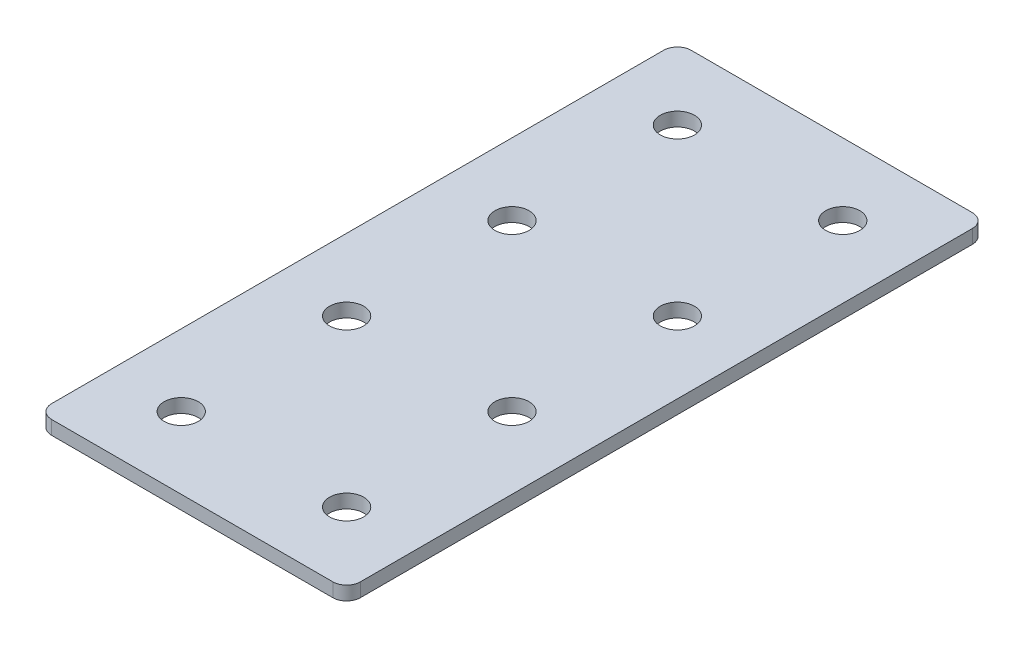
ISO-10303-21;
HEADER;
FILE_DESCRIPTION(('STEP AP214'),'2;1');
FILE_NAME('part.step','',(''),(''),'','','');
FILE_SCHEMA(('AUTOMOTIVE_DESIGN { 1 0 10303 214 1 1 1 1 }'));
ENDSEC;
DATA;
#1=APPLICATION_CONTEXT('core data for automotive mechanical design processes');
#2=APPLICATION_PROTOCOL_DEFINITION('international standard','automotive_design',2000,#1);
#3=PRODUCT_CONTEXT('',#1,'mechanical');
#4=PRODUCT('Part','Part','',(#3));
#5=PRODUCT_RELATED_PRODUCT_CATEGORY('part','',(#4));
#6=PRODUCT_DEFINITION_FORMATION('','',#4);
#7=PRODUCT_DEFINITION_CONTEXT('part definition',#1,'design');
#8=PRODUCT_DEFINITION('design','',#6,#7);
#9=PRODUCT_DEFINITION_SHAPE('','',#8);
#10=(LENGTH_UNIT() NAMED_UNIT(*) SI_UNIT(.MILLI.,.METRE.));
#11=(NAMED_UNIT(*) PLANE_ANGLE_UNIT() SI_UNIT($,.RADIAN.));
#12=(NAMED_UNIT(*) SI_UNIT($,.STERADIAN.) SOLID_ANGLE_UNIT());
#13=UNCERTAINTY_MEASURE_WITH_UNIT(LENGTH_MEASURE(1.E-05),#10,'distance_accuracy_value','');
#14=(GEOMETRIC_REPRESENTATION_CONTEXT(3) GLOBAL_UNCERTAINTY_ASSIGNED_CONTEXT((#13)) GLOBAL_UNIT_ASSIGNED_CONTEXT((#10,
#11,#12)) REPRESENTATION_CONTEXT('',''));
#15=CARTESIAN_POINT('',(0.,0.,0.));
#16=DIRECTION('',(0.,0.,1.));
#17=DIRECTION('',(1.,0.,0.));
#18=AXIS2_PLACEMENT_3D('',#15,#16,#17);
#19=CARTESIAN_POINT('',(-0.724398578086035,0.374792376162532,-45.900129745446));
#20=DIRECTION('',(0.,-1.,0.));
#21=DIRECTION('',(0.,0.,-1.));
#22=AXIS2_PLACEMENT_3D('',#19,#20,#21);
#23=PLANE('',#22);
#24=CARTESIAN_POINT('',(14.275601421914,0.374792376162532,44.099870254554));
#25=DIRECTION('',(0.,1.,0.));
#26=DIRECTION('',(0.,0.,1.));
#27=AXIS2_PLACEMENT_3D('',#24,#25,#26);
#28=CIRCLE('',#27,3.1);
#29=CARTESIAN_POINT('',(14.275601421914,0.374792376162532,47.199870254554));
#30=VERTEX_POINT('',#29);
#31=EDGE_CURVE('E189',#30,#30,#28,.T.);
#32=ORIENTED_EDGE('',*,*,#31,.T.);
#33=EDGE_LOOP('',(#32));
#34=FACE_BOUND('',#33,.T.);
#35=CARTESIAN_POINT('',(-15.7243985780861,0.374792376162532,44.099870254554));
#36=DIRECTION('',(0.,1.,0.));
#37=DIRECTION('',(0.,0.,1.));
#38=AXIS2_PLACEMENT_3D('',#35,#36,#37);
#39=CIRCLE('',#38,3.1);
#40=CARTESIAN_POINT('',(-15.7243985780861,0.374792376162532,47.199870254554));
#41=VERTEX_POINT('',#40);
#42=EDGE_CURVE('E183',#41,#41,#39,.T.);
#43=ORIENTED_EDGE('',*,*,#42,.T.);
#44=EDGE_LOOP('',(#43));
#45=FACE_BOUND('',#44,.T.);
#46=CARTESIAN_POINT('',(14.275601421914,0.374792376162532,14.099870254554));
#47=DIRECTION('',(0.,1.,0.));
#48=DIRECTION('',(0.,0.,1.));
#49=AXIS2_PLACEMENT_3D('',#46,#47,#48);
#50=CIRCLE('',#49,3.1);
#51=CARTESIAN_POINT('',(14.275601421914,0.374792376162532,17.199870254554));
#52=VERTEX_POINT('',#51);
#53=EDGE_CURVE('E177',#52,#52,#50,.T.);
#54=ORIENTED_EDGE('',*,*,#53,.T.);
#55=EDGE_LOOP('',(#54));
#56=FACE_BOUND('',#55,.T.);
#57=CARTESIAN_POINT('',(-15.7243985780861,0.374792376162532,14.099870254554));
#58=DIRECTION('',(0.,1.,0.));
#59=DIRECTION('',(0.,0.,1.));
#60=AXIS2_PLACEMENT_3D('',#57,#58,#59);
#61=CIRCLE('',#60,3.1);
#62=CARTESIAN_POINT('',(-15.7243985780861,0.374792376162532,17.199870254554));
#63=VERTEX_POINT('',#62);
#64=EDGE_CURVE('E171',#63,#63,#61,.T.);
#65=ORIENTED_EDGE('',*,*,#64,.T.);
#66=EDGE_LOOP('',(#65));
#67=FACE_BOUND('',#66,.T.);
#68=CARTESIAN_POINT('',(14.275601421914,0.374792376162532,-15.900129745446));
#69=DIRECTION('',(0.,1.,0.));
#70=DIRECTION('',(0.,0.,1.));
#71=AXIS2_PLACEMENT_3D('',#68,#69,#70);
#72=CIRCLE('',#71,3.1);
#73=CARTESIAN_POINT('',(14.275601421914,0.374792376162532,-12.800129745446));
#74=VERTEX_POINT('',#73);
#75=EDGE_CURVE('E165',#74,#74,#72,.T.);
#76=ORIENTED_EDGE('',*,*,#75,.T.);
#77=EDGE_LOOP('',(#76));
#78=FACE_BOUND('',#77,.T.);
#79=CARTESIAN_POINT('',(-15.7243985780861,0.374792376162532,-15.900129745446));
#80=DIRECTION('',(0.,1.,0.));
#81=DIRECTION('',(0.,0.,1.));
#82=AXIS2_PLACEMENT_3D('',#79,#80,#81);
#83=CIRCLE('',#82,3.1);
#84=CARTESIAN_POINT('',(-15.7243985780861,0.374792376162532,-12.800129745446));
#85=VERTEX_POINT('',#84);
#86=EDGE_CURVE('E159',#85,#85,#83,.T.);
#87=ORIENTED_EDGE('',*,*,#86,.T.);
#88=EDGE_LOOP('',(#87));
#89=FACE_BOUND('',#88,.T.);
#90=CARTESIAN_POINT('',(14.275601421914,0.374792376162532,-45.900129745446));
#91=DIRECTION('',(0.,1.,0.));
#92=DIRECTION('',(0.,0.,1.));
#93=AXIS2_PLACEMENT_3D('',#90,#91,#92);
#94=CIRCLE('',#93,3.1);
#95=CARTESIAN_POINT('',(14.275601421914,0.374792376162532,-42.800129745446));
#96=VERTEX_POINT('',#95);
#97=EDGE_CURVE('E154',#96,#96,#94,.T.);
#98=ORIENTED_EDGE('',*,*,#97,.T.);
#99=EDGE_LOOP('',(#98));
#100=FACE_BOUND('',#99,.T.);
#101=CARTESIAN_POINT('',(-15.7243985780861,0.374792376162532,-45.900129745446));
#102=DIRECTION('',(0.,1.,0.));
#103=DIRECTION('',(0.,0.,1.));
#104=AXIS2_PLACEMENT_3D('',#101,#102,#103);
#105=CIRCLE('',#104,3.1);
#106=CARTESIAN_POINT('',(-15.7243985780861,0.374792376162532,-42.800129745446));
#107=VERTEX_POINT('',#106);
#108=EDGE_CURVE('E147',#107,#107,#105,.T.);
#109=ORIENTED_EDGE('',*,*,#108,.T.);
#110=EDGE_LOOP('',(#109));
#111=FACE_BOUND('',#110,.T.);
#112=DIRECTION('',(0.,0.,-1.));
#113=VECTOR('',#112,1.);
#114=CARTESIAN_POINT('',(27.2756014219141,0.374792376162532,57.0998702545539));
#115=LINE('',#114,#113);
#116=CARTESIAN_POINT('',(27.2756014219141,0.374792376162532,54.5998702545539));
#117=VERTEX_POINT('',#116);
#118=CARTESIAN_POINT('',(27.2756014219141,0.374792376162532,-56.400129745446));
#119=VERTEX_POINT('',#118);
#120=EDGE_CURVE('E106',#117,#119,#115,.T.);
#121=ORIENTED_EDGE('',*,*,#120,.F.);
#122=CARTESIAN_POINT('',(24.7756014219141,0.374792376162532,54.5998702545539));
#123=DIRECTION('',(0.,-1.,0.));
#124=DIRECTION('',(0.,0.,-1.));
#125=AXIS2_PLACEMENT_3D('',#122,#123,#124);
#126=CIRCLE('',#125,2.5);
#127=CARTESIAN_POINT('',(24.7756014219141,0.374792376162532,57.0998702545539));
#128=VERTEX_POINT('',#127);
#129=EDGE_CURVE('E128',#117,#128,#126,.T.);
#130=ORIENTED_EDGE('',*,*,#129,.T.);
#131=DIRECTION('',(1.,0.,0.));
#132=VECTOR('',#131,1.);
#133=CARTESIAN_POINT('',(-28.7243985780861,0.374792376162532,57.0998702545539));
#134=LINE('',#133,#132);
#135=CARTESIAN_POINT('',(-26.2243985780861,0.374792376162532,57.0998702545539));
#136=VERTEX_POINT('',#135);
#137=EDGE_CURVE('E110',#136,#128,#134,.T.);
#138=ORIENTED_EDGE('',*,*,#137,.F.);
#139=CARTESIAN_POINT('',(-26.2243985780861,0.374792376162532,54.5998702545539));
#140=DIRECTION('',(0.,-1.,0.));
#141=DIRECTION('',(0.,0.,-1.));
#142=AXIS2_PLACEMENT_3D('',#139,#140,#141);
#143=CIRCLE('',#142,2.5);
#144=CARTESIAN_POINT('',(-28.7243985780861,0.374792376162532,54.5998702545539));
#145=VERTEX_POINT('',#144);
#146=EDGE_CURVE('E105',#136,#145,#143,.T.);
#147=ORIENTED_EDGE('',*,*,#146,.T.);
#148=DIRECTION('',(0.,0.,1.));
#149=VECTOR('',#148,1.);
#150=CARTESIAN_POINT('',(-28.7243985780861,0.374792376162532,-58.9001297454461));
#151=LINE('',#150,#149);
#152=CARTESIAN_POINT('',(-28.7243985780861,0.374792376162532,-56.4001297454461));
#153=VERTEX_POINT('',#152);
#154=EDGE_CURVE('E137',#153,#145,#151,.T.);
#155=ORIENTED_EDGE('',*,*,#154,.F.);
#156=CARTESIAN_POINT('',(-26.2243985780861,0.374792376162532,-56.4001297454461));
#157=DIRECTION('',(0.,-1.,0.));
#158=DIRECTION('',(0.,0.,-1.));
#159=AXIS2_PLACEMENT_3D('',#156,#157,#158);
#160=CIRCLE('',#159,2.5);
#161=CARTESIAN_POINT('',(-26.2243985780861,0.374792376162532,-58.9001297454461));
#162=VERTEX_POINT('',#161);
#163=EDGE_CURVE('E31',#153,#162,#160,.T.);
#164=ORIENTED_EDGE('',*,*,#163,.T.);
#165=DIRECTION('',(-1.,0.,0.));
#166=VECTOR('',#165,1.);
#167=CARTESIAN_POINT('',(27.2756014219141,0.374792376162532,-58.9001297454461));
#168=LINE('',#167,#166);
#169=CARTESIAN_POINT('',(24.7756014219141,0.374792376162532,-58.9001297454461));
#170=VERTEX_POINT('',#169);
#171=EDGE_CURVE('E138',#170,#162,#168,.T.);
#172=ORIENTED_EDGE('',*,*,#171,.F.);
#173=CARTESIAN_POINT('',(24.7756014219141,0.374792376162532,-56.4001297454461));
#174=DIRECTION('',(0.,-1.,0.));
#175=DIRECTION('',(0.,0.,-1.));
#176=AXIS2_PLACEMENT_3D('',#173,#174,#175);
#177=CIRCLE('',#176,2.5);
#178=EDGE_CURVE('E126',#170,#119,#177,.T.);
#179=ORIENTED_EDGE('',*,*,#178,.T.);
#180=EDGE_LOOP('',(#121,#130,#138,#147,#155,#164,#172,#179));
#181=FACE_BOUND('',#180,.T.);
#182=ADVANCED_FACE('F16',(#34,#45,#56,#67,#78,#89,#100,#111,#181),#23,.T.);
#183=CARTESIAN_POINT('',(27.2756014219141,0.374792376162532,-58.9001297454461));
#184=DIRECTION('',(0.,0.,-1.));
#185=DIRECTION('',(-1.,0.,0.));
#186=AXIS2_PLACEMENT_3D('',#183,#184,#185);
#187=PLANE('',#186);
#188=DIRECTION('',(-1.,0.,0.));
#189=VECTOR('',#188,1.);
#190=CARTESIAN_POINT('',(27.2756014219141,2.87479237616253,-58.9001297454461));
#191=LINE('',#190,#189);
#192=CARTESIAN_POINT('',(24.7756014219141,2.87479237616253,-58.9001297454461));
#193=VERTEX_POINT('',#192);
#194=CARTESIAN_POINT('',(-26.2243985780861,2.87479237616253,-58.9001297454461));
#195=VERTEX_POINT('',#194);
#196=EDGE_CURVE('E144',#193,#195,#191,.T.);
#197=ORIENTED_EDGE('',*,*,#196,.F.);
#198=DIRECTION('',(0.,1.,0.));
#199=VECTOR('',#198,1.);
#200=CARTESIAN_POINT('',(24.7756014219141,0.374792376162532,-58.9001297454461));
#201=LINE('',#200,#199);
#202=EDGE_CURVE('E38',#193,#170,#201,.F.);
#203=ORIENTED_EDGE('',*,*,#202,.T.);
#204=ORIENTED_EDGE('',*,*,#171,.T.);
#205=DIRECTION('',(0.,1.,0.));
#206=VECTOR('',#205,1.);
#207=CARTESIAN_POINT('',(-26.2243985780861,0.374792376162532,-58.9001297454461));
#208=LINE('',#207,#206);
#209=EDGE_CURVE('E130',#162,#195,#208,.T.);
#210=ORIENTED_EDGE('',*,*,#209,.T.);
#211=EDGE_LOOP('',(#197,#203,#204,#210));
#212=FACE_BOUND('',#211,.T.);
#213=ADVANCED_FACE('F239',(#212),#187,.T.);
#214=CARTESIAN_POINT('',(27.2756014219141,0.374792376162532,57.0998702545539));
#215=DIRECTION('',(1.,0.,0.));
#216=DIRECTION('',(0.,0.,-1.));
#217=AXIS2_PLACEMENT_3D('',#214,#215,#216);
#218=PLANE('',#217);
#219=DIRECTION('',(0.,0.,-1.));
#220=VECTOR('',#219,1.);
#221=CARTESIAN_POINT('',(27.2756014219141,2.87479237616253,57.0998702545539));
#222=LINE('',#221,#220);
#223=CARTESIAN_POINT('',(27.2756014219141,2.87479237616253,54.5998702545539));
#224=VERTEX_POINT('',#223);
#225=CARTESIAN_POINT('',(27.2756014219141,2.87479237616253,-56.400129745446));
#226=VERTEX_POINT('',#225);
#227=EDGE_CURVE('E102',#224,#226,#222,.T.);
#228=ORIENTED_EDGE('',*,*,#227,.F.);
#229=DIRECTION('',(0.,1.,0.));
#230=VECTOR('',#229,1.);
#231=CARTESIAN_POINT('',(27.2756014219141,0.374792376162532,54.5998702545539));
#232=LINE('',#231,#230);
#233=EDGE_CURVE('E122',#224,#117,#232,.F.);
#234=ORIENTED_EDGE('',*,*,#233,.T.);
#235=ORIENTED_EDGE('',*,*,#120,.T.);
#236=DIRECTION('',(0.,1.,0.));
#237=VECTOR('',#236,1.);
#238=CARTESIAN_POINT('',(27.2756014219141,0.374792376162532,-56.4001297454461));
#239=LINE('',#238,#237);
#240=EDGE_CURVE('E119',#119,#226,#239,.T.);
#241=ORIENTED_EDGE('',*,*,#240,.T.);
#242=EDGE_LOOP('',(#228,#234,#235,#241));
#243=FACE_BOUND('',#242,.T.);
#244=ADVANCED_FACE('F244',(#243),#218,.T.);
#245=CARTESIAN_POINT('',(-28.7243985780861,0.374792376162532,57.0998702545539));
#246=DIRECTION('',(0.,0.,1.));
#247=DIRECTION('',(1.,0.,0.));
#248=AXIS2_PLACEMENT_3D('',#245,#246,#247);
#249=PLANE('',#248);
#250=ORIENTED_EDGE('',*,*,#137,.T.);
#251=DIRECTION('',(0.,1.,0.));
#252=VECTOR('',#251,1.);
#253=CARTESIAN_POINT('',(24.7756014219141,0.374792376162532,57.0998702545539));
#254=LINE('',#253,#252);
#255=CARTESIAN_POINT('',(24.7756014219141,2.87479237616253,57.0998702545539));
#256=VERTEX_POINT('',#255);
#257=EDGE_CURVE('E93',#128,#256,#254,.T.);
#258=ORIENTED_EDGE('',*,*,#257,.T.);
#259=DIRECTION('',(1.,0.,0.));
#260=VECTOR('',#259,1.);
#261=CARTESIAN_POINT('',(-28.7243985780861,2.87479237616253,57.0998702545539));
#262=LINE('',#261,#260);
#263=CARTESIAN_POINT('',(-26.2243985780861,2.87479237616253,57.0998702545539));
#264=VERTEX_POINT('',#263);
#265=EDGE_CURVE('E85',#264,#256,#262,.T.);
#266=ORIENTED_EDGE('',*,*,#265,.F.);
#267=DIRECTION('',(0.,1.,0.));
#268=VECTOR('',#267,1.);
#269=CARTESIAN_POINT('',(-26.2243985780861,0.374792376162532,57.0998702545539));
#270=LINE('',#269,#268);
#271=EDGE_CURVE('E99',#264,#136,#270,.F.);
#272=ORIENTED_EDGE('',*,*,#271,.T.);
#273=EDGE_LOOP('',(#250,#258,#266,#272));
#274=FACE_BOUND('',#273,.T.);
#275=ADVANCED_FACE('F98',(#274),#249,.T.);
#276=CARTESIAN_POINT('',(-28.7243985780861,0.374792376162532,-58.9001297454461));
#277=DIRECTION('',(-1.,0.,0.));
#278=DIRECTION('',(0.,0.,1.));
#279=AXIS2_PLACEMENT_3D('',#276,#277,#278);
#280=PLANE('',#279);
#281=DIRECTION('',(0.,0.,1.));
#282=VECTOR('',#281,1.);
#283=CARTESIAN_POINT('',(-28.7243985780861,2.87479237616253,-58.9001297454461));
#284=LINE('',#283,#282);
#285=CARTESIAN_POINT('',(-28.7243985780861,2.87479237616253,-56.4001297454461));
#286=VERTEX_POINT('',#285);
#287=CARTESIAN_POINT('',(-28.7243985780861,2.87479237616253,54.5998702545539));
#288=VERTEX_POINT('',#287);
#289=EDGE_CURVE('E87',#286,#288,#284,.T.);
#290=ORIENTED_EDGE('',*,*,#289,.F.);
#291=DIRECTION('',(0.,1.,0.));
#292=VECTOR('',#291,1.);
#293=CARTESIAN_POINT('',(-28.7243985780861,0.374792376162532,-56.4001297454461));
#294=LINE('',#293,#292);
#295=EDGE_CURVE('E10',#286,#153,#294,.F.);
#296=ORIENTED_EDGE('',*,*,#295,.T.);
#297=ORIENTED_EDGE('',*,*,#154,.T.);
#298=DIRECTION('',(0.,1.,0.));
#299=VECTOR('',#298,1.);
#300=CARTESIAN_POINT('',(-28.7243985780861,0.374792376162532,54.5998702545539));
#301=LINE('',#300,#299);
#302=EDGE_CURVE('E24',#145,#288,#301,.T.);
#303=ORIENTED_EDGE('',*,*,#302,.T.);
#304=EDGE_LOOP('',(#290,#296,#297,#303));
#305=FACE_BOUND('',#304,.T.);
#306=ADVANCED_FACE('F135',(#305),#280,.T.);
#307=CARTESIAN_POINT('',(-0.724398578086035,2.87479237616253,-45.900129745446));
#308=DIRECTION('',(0.,-1.,0.));
#309=DIRECTION('',(0.,0.,-1.));
#310=AXIS2_PLACEMENT_3D('',#307,#308,#309);
#311=PLANE('',#310);
#312=CARTESIAN_POINT('',(14.275601421914,2.87479237616253,44.099870254554));
#313=DIRECTION('',(0.,1.,0.));
#314=DIRECTION('',(0.,0.,1.));
#315=AXIS2_PLACEMENT_3D('',#312,#313,#314);
#316=CIRCLE('',#315,3.1);
#317=CARTESIAN_POINT('',(14.275601421914,2.87479237616253,47.199870254554));
#318=VERTEX_POINT('',#317);
#319=EDGE_CURVE('E192',#318,#318,#316,.T.);
#320=ORIENTED_EDGE('',*,*,#319,.F.);
#321=EDGE_LOOP('',(#320));
#322=FACE_BOUND('',#321,.T.);
#323=CARTESIAN_POINT('',(-15.7243985780861,2.87479237616253,44.099870254554));
#324=DIRECTION('',(0.,1.,0.));
#325=DIRECTION('',(0.,0.,1.));
#326=AXIS2_PLACEMENT_3D('',#323,#324,#325);
#327=CIRCLE('',#326,3.1);
#328=CARTESIAN_POINT('',(-15.7243985780861,2.87479237616253,47.199870254554));
#329=VERTEX_POINT('',#328);
#330=EDGE_CURVE('E186',#329,#329,#327,.T.);
#331=ORIENTED_EDGE('',*,*,#330,.F.);
#332=EDGE_LOOP('',(#331));
#333=FACE_BOUND('',#332,.T.);
#334=CARTESIAN_POINT('',(14.275601421914,2.87479237616253,14.099870254554));
#335=DIRECTION('',(0.,1.,0.));
#336=DIRECTION('',(0.,0.,1.));
#337=AXIS2_PLACEMENT_3D('',#334,#335,#336);
#338=CIRCLE('',#337,3.1);
#339=CARTESIAN_POINT('',(14.275601421914,2.87479237616253,17.199870254554));
#340=VERTEX_POINT('',#339);
#341=EDGE_CURVE('E180',#340,#340,#338,.T.);
#342=ORIENTED_EDGE('',*,*,#341,.F.);
#343=EDGE_LOOP('',(#342));
#344=FACE_BOUND('',#343,.T.);
#345=CARTESIAN_POINT('',(-15.7243985780861,2.87479237616253,14.099870254554));
#346=DIRECTION('',(0.,1.,0.));
#347=DIRECTION('',(0.,0.,1.));
#348=AXIS2_PLACEMENT_3D('',#345,#346,#347);
#349=CIRCLE('',#348,3.1);
#350=CARTESIAN_POINT('',(-15.7243985780861,2.87479237616253,17.199870254554));
#351=VERTEX_POINT('',#350);
#352=EDGE_CURVE('E174',#351,#351,#349,.T.);
#353=ORIENTED_EDGE('',*,*,#352,.F.);
#354=EDGE_LOOP('',(#353));
#355=FACE_BOUND('',#354,.T.);
#356=CARTESIAN_POINT('',(14.275601421914,2.87479237616253,-15.900129745446));
#357=DIRECTION('',(0.,1.,0.));
#358=DIRECTION('',(0.,0.,1.));
#359=AXIS2_PLACEMENT_3D('',#356,#357,#358);
#360=CIRCLE('',#359,3.1);
#361=CARTESIAN_POINT('',(14.275601421914,2.87479237616253,-12.800129745446));
#362=VERTEX_POINT('',#361);
#363=EDGE_CURVE('E168',#362,#362,#360,.T.);
#364=ORIENTED_EDGE('',*,*,#363,.F.);
#365=EDGE_LOOP('',(#364));
#366=FACE_BOUND('',#365,.T.);
#367=CARTESIAN_POINT('',(-15.7243985780861,2.87479237616253,-15.900129745446));
#368=DIRECTION('',(0.,1.,0.));
#369=DIRECTION('',(0.,0.,1.));
#370=AXIS2_PLACEMENT_3D('',#367,#368,#369);
#371=CIRCLE('',#370,3.1);
#372=CARTESIAN_POINT('',(-15.7243985780861,2.87479237616253,-12.800129745446));
#373=VERTEX_POINT('',#372);
#374=EDGE_CURVE('E162',#373,#373,#371,.T.);
#375=ORIENTED_EDGE('',*,*,#374,.F.);
#376=EDGE_LOOP('',(#375));
#377=FACE_BOUND('',#376,.T.);
#378=CARTESIAN_POINT('',(14.275601421914,2.87479237616253,-45.900129745446));
#379=DIRECTION('',(0.,1.,0.));
#380=DIRECTION('',(0.,0.,1.));
#381=AXIS2_PLACEMENT_3D('',#378,#379,#380);
#382=CIRCLE('',#381,3.1);
#383=CARTESIAN_POINT('',(14.275601421914,2.87479237616253,-42.800129745446));
#384=VERTEX_POINT('',#383);
#385=EDGE_CURVE('E156',#384,#384,#382,.T.);
#386=ORIENTED_EDGE('',*,*,#385,.F.);
#387=EDGE_LOOP('',(#386));
#388=FACE_BOUND('',#387,.T.);
#389=CARTESIAN_POINT('',(-15.7243985780861,2.87479237616253,-45.900129745446));
#390=DIRECTION('',(0.,1.,0.));
#391=DIRECTION('',(0.,0.,1.));
#392=AXIS2_PLACEMENT_3D('',#389,#390,#391);
#393=CIRCLE('',#392,3.1);
#394=CARTESIAN_POINT('',(-15.7243985780861,2.87479237616253,-42.800129745446));
#395=VERTEX_POINT('',#394);
#396=EDGE_CURVE('E149',#395,#395,#393,.T.);
#397=ORIENTED_EDGE('',*,*,#396,.F.);
#398=EDGE_LOOP('',(#397));
#399=FACE_BOUND('',#398,.T.);
#400=ORIENTED_EDGE('',*,*,#265,.T.);
#401=CARTESIAN_POINT('',(24.7756014219141,2.87479237616253,54.5998702545539));
#402=DIRECTION('',(0.,-1.,0.));
#403=DIRECTION('',(0.,0.,-1.));
#404=AXIS2_PLACEMENT_3D('',#401,#402,#403);
#405=CIRCLE('',#404,2.5);
#406=EDGE_CURVE('E117',#256,#224,#405,.F.);
#407=ORIENTED_EDGE('',*,*,#406,.T.);
#408=ORIENTED_EDGE('',*,*,#227,.T.);
#409=CARTESIAN_POINT('',(24.7756014219141,2.87479237616253,-56.4001297454461));
#410=DIRECTION('',(0.,-1.,0.));
#411=DIRECTION('',(0.,0.,-1.));
#412=AXIS2_PLACEMENT_3D('',#409,#410,#411);
#413=CIRCLE('',#412,2.5);
#414=EDGE_CURVE('E115',#226,#193,#413,.F.);
#415=ORIENTED_EDGE('',*,*,#414,.T.);
#416=ORIENTED_EDGE('',*,*,#196,.T.);
#417=CARTESIAN_POINT('',(-26.2243985780861,2.87479237616253,-56.4001297454461));
#418=DIRECTION('',(0.,-1.,0.));
#419=DIRECTION('',(0.,0.,-1.));
#420=AXIS2_PLACEMENT_3D('',#417,#418,#419);
#421=CIRCLE('',#420,2.5);
#422=EDGE_CURVE('E92',#195,#286,#421,.F.);
#423=ORIENTED_EDGE('',*,*,#422,.T.);
#424=ORIENTED_EDGE('',*,*,#289,.T.);
#425=CARTESIAN_POINT('',(-26.2243985780861,2.87479237616253,54.5998702545539));
#426=DIRECTION('',(0.,-1.,0.));
#427=DIRECTION('',(0.,0.,-1.));
#428=AXIS2_PLACEMENT_3D('',#425,#426,#427);
#429=CIRCLE('',#428,2.5);
#430=EDGE_CURVE('E82',#288,#264,#429,.F.);
#431=ORIENTED_EDGE('',*,*,#430,.T.);
#432=EDGE_LOOP('',(#400,#407,#408,#415,#416,#423,#424,#431));
#433=FACE_BOUND('',#432,.T.);
#434=ADVANCED_FACE('F84',(#322,#333,#344,#355,#366,#377,#388,#399,#433),#311,.F.);
#435=CARTESIAN_POINT('',(-15.7243985780861,0.374792376162532,-45.900129745446));
#436=DIRECTION('',(0.,1.,0.));
#437=DIRECTION('',(0.,0.,1.));
#438=AXIS2_PLACEMENT_3D('',#435,#436,#437);
#439=CYLINDRICAL_SURFACE('',#438,3.1);
#440=ORIENTED_EDGE('',*,*,#108,.F.);
#441=EDGE_LOOP('',(#440));
#442=FACE_BOUND('',#441,.T.);
#443=ORIENTED_EDGE('',*,*,#396,.T.);
#444=EDGE_LOOP('',(#443));
#445=FACE_BOUND('',#444,.T.);
#446=ADVANCED_FACE('F210',(#442,#445),#439,.F.);
#447=CARTESIAN_POINT('',(14.275601421914,0.374792376162532,-45.900129745446));
#448=DIRECTION('',(0.,1.,0.));
#449=DIRECTION('',(0.,0.,1.));
#450=AXIS2_PLACEMENT_3D('',#447,#448,#449);
#451=CYLINDRICAL_SURFACE('',#450,3.1);
#452=ORIENTED_EDGE('',*,*,#97,.F.);
#453=EDGE_LOOP('',(#452));
#454=FACE_BOUND('',#453,.T.);
#455=ORIENTED_EDGE('',*,*,#385,.T.);
#456=EDGE_LOOP('',(#455));
#457=FACE_BOUND('',#456,.T.);
#458=ADVANCED_FACE('F227',(#454,#457),#451,.F.);
#459=CARTESIAN_POINT('',(-15.7243985780861,0.374792376162532,-15.900129745446));
#460=DIRECTION('',(0.,1.,0.));
#461=DIRECTION('',(0.,0.,1.));
#462=AXIS2_PLACEMENT_3D('',#459,#460,#461);
#463=CYLINDRICAL_SURFACE('',#462,3.1);
#464=ORIENTED_EDGE('',*,*,#86,.F.);
#465=EDGE_LOOP('',(#464));
#466=FACE_BOUND('',#465,.T.);
#467=ORIENTED_EDGE('',*,*,#374,.T.);
#468=EDGE_LOOP('',(#467));
#469=FACE_BOUND('',#468,.T.);
#470=ADVANCED_FACE('F234',(#466,#469),#463,.F.);
#471=CARTESIAN_POINT('',(14.275601421914,0.374792376162532,-15.900129745446));
#472=DIRECTION('',(0.,1.,0.));
#473=DIRECTION('',(0.,0.,1.));
#474=AXIS2_PLACEMENT_3D('',#471,#472,#473);
#475=CYLINDRICAL_SURFACE('',#474,3.1);
#476=ORIENTED_EDGE('',*,*,#75,.F.);
#477=EDGE_LOOP('',(#476));
#478=FACE_BOUND('',#477,.T.);
#479=ORIENTED_EDGE('',*,*,#363,.T.);
#480=EDGE_LOOP('',(#479));
#481=FACE_BOUND('',#480,.T.);
#482=ADVANCED_FACE('F307',(#478,#481),#475,.F.);
#483=CARTESIAN_POINT('',(-15.7243985780861,0.374792376162532,14.099870254554));
#484=DIRECTION('',(0.,1.,0.));
#485=DIRECTION('',(0.,0.,1.));
#486=AXIS2_PLACEMENT_3D('',#483,#484,#485);
#487=CYLINDRICAL_SURFACE('',#486,3.1);
#488=ORIENTED_EDGE('',*,*,#64,.F.);
#489=EDGE_LOOP('',(#488));
#490=FACE_BOUND('',#489,.T.);
#491=ORIENTED_EDGE('',*,*,#352,.T.);
#492=EDGE_LOOP('',(#491));
#493=FACE_BOUND('',#492,.T.);
#494=ADVANCED_FACE('F317',(#490,#493),#487,.F.);
#495=CARTESIAN_POINT('',(14.275601421914,0.374792376162532,14.099870254554));
#496=DIRECTION('',(0.,1.,0.));
#497=DIRECTION('',(0.,0.,1.));
#498=AXIS2_PLACEMENT_3D('',#495,#496,#497);
#499=CYLINDRICAL_SURFACE('',#498,3.1);
#500=ORIENTED_EDGE('',*,*,#53,.F.);
#501=EDGE_LOOP('',(#500));
#502=FACE_BOUND('',#501,.T.);
#503=ORIENTED_EDGE('',*,*,#341,.T.);
#504=EDGE_LOOP('',(#503));
#505=FACE_BOUND('',#504,.T.);
#506=ADVANCED_FACE('F327',(#502,#505),#499,.F.);
#507=CARTESIAN_POINT('',(-15.7243985780861,0.374792376162532,44.099870254554));
#508=DIRECTION('',(0.,1.,0.));
#509=DIRECTION('',(0.,0.,1.));
#510=AXIS2_PLACEMENT_3D('',#507,#508,#509);
#511=CYLINDRICAL_SURFACE('',#510,3.1);
#512=ORIENTED_EDGE('',*,*,#42,.F.);
#513=EDGE_LOOP('',(#512));
#514=FACE_BOUND('',#513,.T.);
#515=ORIENTED_EDGE('',*,*,#330,.T.);
#516=EDGE_LOOP('',(#515));
#517=FACE_BOUND('',#516,.T.);
#518=ADVANCED_FACE('F204',(#514,#517),#511,.F.);
#519=CARTESIAN_POINT('',(14.275601421914,0.374792376162532,44.099870254554));
#520=DIRECTION('',(0.,1.,0.));
#521=DIRECTION('',(0.,0.,1.));
#522=AXIS2_PLACEMENT_3D('',#519,#520,#521);
#523=CYLINDRICAL_SURFACE('',#522,3.1);
#524=ORIENTED_EDGE('',*,*,#31,.F.);
#525=EDGE_LOOP('',(#524));
#526=FACE_BOUND('',#525,.T.);
#527=ORIENTED_EDGE('',*,*,#319,.T.);
#528=EDGE_LOOP('',(#527));
#529=FACE_BOUND('',#528,.T.);
#530=ADVANCED_FACE('F200',(#526,#529),#523,.F.);
#531=CARTESIAN_POINT('',(24.7756014219141,0.374792376162532,54.5998702545539));
#532=DIRECTION('',(0.,1.,0.));
#533=DIRECTION('',(0.,0.,1.));
#534=AXIS2_PLACEMENT_3D('',#531,#532,#533);
#535=CYLINDRICAL_SURFACE('',#534,2.5);
#536=ORIENTED_EDGE('',*,*,#129,.F.);
#537=ORIENTED_EDGE('',*,*,#233,.F.);
#538=ORIENTED_EDGE('',*,*,#406,.F.);
#539=ORIENTED_EDGE('',*,*,#257,.F.);
#540=EDGE_LOOP('',(#536,#537,#538,#539));
#541=FACE_BOUND('',#540,.T.);
#542=ADVANCED_FACE('F203',(#541),#535,.T.);
#543=CARTESIAN_POINT('',(24.7756014219141,0.374792376162532,-56.4001297454461));
#544=DIRECTION('',(0.,1.,0.));
#545=DIRECTION('',(0.,0.,1.));
#546=AXIS2_PLACEMENT_3D('',#543,#544,#545);
#547=CYLINDRICAL_SURFACE('',#546,2.5);
#548=ORIENTED_EDGE('',*,*,#178,.F.);
#549=ORIENTED_EDGE('',*,*,#202,.F.);
#550=ORIENTED_EDGE('',*,*,#414,.F.);
#551=ORIENTED_EDGE('',*,*,#240,.F.);
#552=EDGE_LOOP('',(#548,#549,#550,#551));
#553=FACE_BOUND('',#552,.T.);
#554=ADVANCED_FACE('F249',(#553),#547,.T.);
#555=CARTESIAN_POINT('',(-26.2243985780861,0.374792376162532,-56.4001297454461));
#556=DIRECTION('',(0.,1.,0.));
#557=DIRECTION('',(0.,0.,1.));
#558=AXIS2_PLACEMENT_3D('',#555,#556,#557);
#559=CYLINDRICAL_SURFACE('',#558,2.5);
#560=ORIENTED_EDGE('',*,*,#163,.F.);
#561=ORIENTED_EDGE('',*,*,#295,.F.);
#562=ORIENTED_EDGE('',*,*,#422,.F.);
#563=ORIENTED_EDGE('',*,*,#209,.F.);
#564=EDGE_LOOP('',(#560,#561,#562,#563));
#565=FACE_BOUND('',#564,.T.);
#566=ADVANCED_FACE('F252',(#565),#559,.T.);
#567=CARTESIAN_POINT('',(-26.2243985780861,0.374792376162532,54.5998702545539));
#568=DIRECTION('',(0.,1.,0.));
#569=DIRECTION('',(0.,0.,1.));
#570=AXIS2_PLACEMENT_3D('',#567,#568,#569);
#571=CYLINDRICAL_SURFACE('',#570,2.5);
#572=ORIENTED_EDGE('',*,*,#146,.F.);
#573=ORIENTED_EDGE('',*,*,#271,.F.);
#574=ORIENTED_EDGE('',*,*,#430,.F.);
#575=ORIENTED_EDGE('',*,*,#302,.F.);
#576=EDGE_LOOP('',(#572,#573,#574,#575));
#577=FACE_BOUND('',#576,.T.);
#578=ADVANCED_FACE('F18',(#577),#571,.T.);
#579=CLOSED_SHELL('',(#182,#213,#244,#275,#306,#434,#446,#458,#470,#482,#494,#506,#518,#530,
#542,#554,#566,#578));
#580=MANIFOLD_SOLID_BREP('B1',#579);
#581=ADVANCED_BREP_SHAPE_REPRESENTATION('',(#18,#580),#14);
#582=SHAPE_DEFINITION_REPRESENTATION(#9,#581);
ENDSEC;
END-ISO-10303-21;
